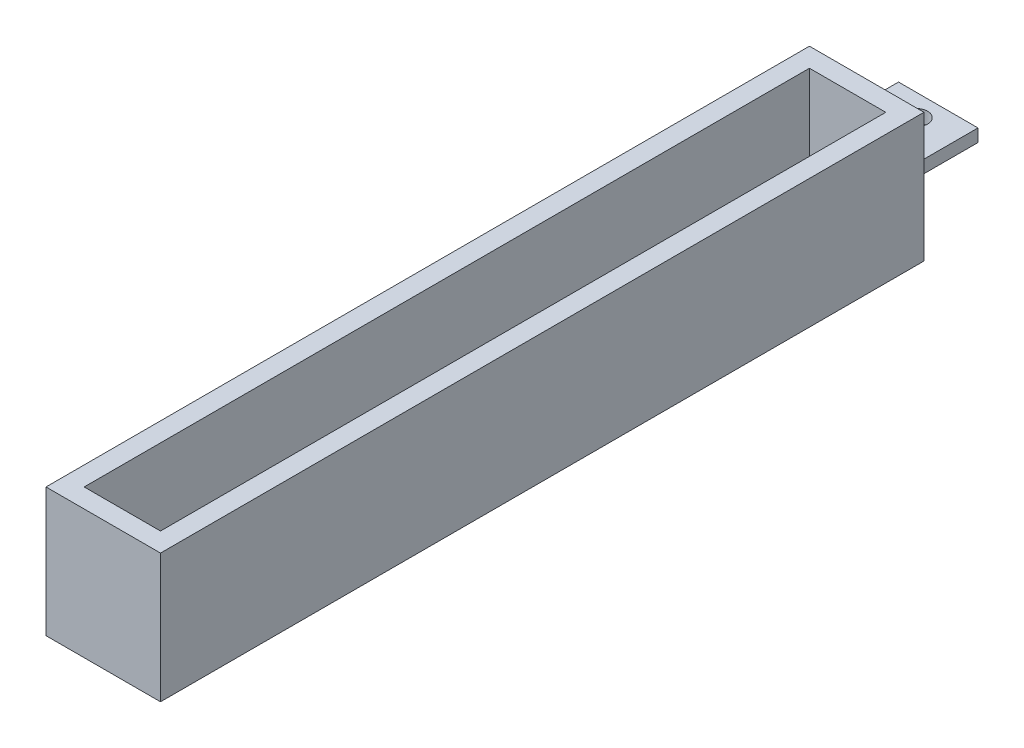
ISO-10303-21;
HEADER;
FILE_DESCRIPTION(('STEP AP214'),'2;1');
FILE_NAME('part.step','',(''),(''),'','','');
FILE_SCHEMA(('AUTOMOTIVE_DESIGN { 1 0 10303 214 1 1 1 1 }'));
ENDSEC;
DATA;
#1=APPLICATION_CONTEXT('core data for automotive mechanical design processes');
#2=APPLICATION_PROTOCOL_DEFINITION('international standard','automotive_design',2000,#1);
#3=PRODUCT_CONTEXT('',#1,'mechanical');
#4=PRODUCT('Part','Part','',(#3));
#5=PRODUCT_RELATED_PRODUCT_CATEGORY('part','',(#4));
#6=PRODUCT_DEFINITION_FORMATION('','',#4);
#7=PRODUCT_DEFINITION_CONTEXT('part definition',#1,'design');
#8=PRODUCT_DEFINITION('design','',#6,#7);
#9=PRODUCT_DEFINITION_SHAPE('','',#8);
#10=(LENGTH_UNIT() NAMED_UNIT(*) SI_UNIT(.MILLI.,.METRE.));
#11=(NAMED_UNIT(*) PLANE_ANGLE_UNIT() SI_UNIT($,.RADIAN.));
#12=(NAMED_UNIT(*) SI_UNIT($,.STERADIAN.) SOLID_ANGLE_UNIT());
#13=UNCERTAINTY_MEASURE_WITH_UNIT(LENGTH_MEASURE(1.E-05),#10,'distance_accuracy_value','');
#14=(GEOMETRIC_REPRESENTATION_CONTEXT(3) GLOBAL_UNCERTAINTY_ASSIGNED_CONTEXT((#13)) GLOBAL_UNIT_ASSIGNED_CONTEXT((#10,
#11,#12)) REPRESENTATION_CONTEXT('',''));
#15=CARTESIAN_POINT('',(0.,0.,0.));
#16=DIRECTION('',(0.,0.,1.));
#17=DIRECTION('',(1.,0.,0.));
#18=AXIS2_PLACEMENT_3D('',#15,#16,#17);
#19=CARTESIAN_POINT('',(0.,0.,0.));
#20=DIRECTION('',(0.,0.,-1.));
#21=DIRECTION('',(-1.,0.,0.));
#22=AXIS2_PLACEMENT_3D('',#19,#20,#21);
#23=PLANE('',#22);
#24=DIRECTION('',(0.,-1.,0.));
#25=VECTOR('',#24,1.);
#26=CARTESIAN_POINT('',(0.,0.,0.));
#27=LINE('',#26,#25);
#28=CARTESIAN_POINT('',(0.,27.,0.));
#29=VERTEX_POINT('',#28);
#30=CARTESIAN_POINT('',(0.,0.,0.));
#31=VERTEX_POINT('',#30);
#32=EDGE_CURVE('E160',#29,#31,#27,.T.);
#33=ORIENTED_EDGE('',*,*,#32,.F.);
#34=DIRECTION('',(-1.,0.,0.));
#35=VECTOR('',#34,1.);
#36=CARTESIAN_POINT('',(0.,27.,0.));
#37=LINE('',#36,#35);
#38=CARTESIAN_POINT('',(24.,27.,0.));
#39=VERTEX_POINT('',#38);
#40=EDGE_CURVE('E187',#39,#29,#37,.T.);
#41=ORIENTED_EDGE('',*,*,#40,.F.);
#42=DIRECTION('',(0.,1.,0.));
#43=VECTOR('',#42,1.);
#44=CARTESIAN_POINT('',(24.,0.,0.));
#45=LINE('',#44,#43);
#46=CARTESIAN_POINT('',(24.,0.,0.));
#47=VERTEX_POINT('',#46);
#48=EDGE_CURVE('E198',#47,#39,#45,.T.);
#49=ORIENTED_EDGE('',*,*,#48,.F.);
#50=DIRECTION('',(1.,0.,0.));
#51=VECTOR('',#50,1.);
#52=CARTESIAN_POINT('',(0.,0.,0.));
#53=LINE('',#52,#51);
#54=EDGE_CURVE('E196',#31,#47,#53,.T.);
#55=ORIENTED_EDGE('',*,*,#54,.F.);
#56=EDGE_LOOP('',(#33,#41,#49,#55));
#57=FACE_BOUND('',#56,.T.);
#58=DIRECTION('',(1.,0.,0.));
#59=VECTOR('',#58,1.);
#60=CARTESIAN_POINT('',(3.67203168883634,14.8278231899865,0.));
#61=LINE('',#60,#59);
#62=CARTESIAN_POINT('',(3.67203168883634,14.8278231899865,0.));
#63=VERTEX_POINT('',#62);
#64=CARTESIAN_POINT('',(20.3279683111637,14.8278231899865,0.));
#65=VERTEX_POINT('',#64);
#66=EDGE_CURVE('E289',#63,#65,#61,.T.);
#67=ORIENTED_EDGE('',*,*,#66,.F.);
#68=DIRECTION('',(0.,1.,0.));
#69=VECTOR('',#68,1.);
#70=CARTESIAN_POINT('',(3.67203168883634,14.8278231899865,0.));
#71=LINE('',#70,#69);
#72=CARTESIAN_POINT('',(3.67203168883634,12.1721768100135,0.));
#73=VERTEX_POINT('',#72);
#74=EDGE_CURVE('E147',#73,#63,#71,.T.);
#75=ORIENTED_EDGE('',*,*,#74,.F.);
#76=DIRECTION('',(-1.,0.,0.));
#77=VECTOR('',#76,1.);
#78=CARTESIAN_POINT('',(3.67203168883634,12.1721768100135,0.));
#79=LINE('',#78,#77);
#80=CARTESIAN_POINT('',(20.3279683111637,12.1721768100135,0.));
#81=VERTEX_POINT('',#80);
#82=EDGE_CURVE('E143',#81,#73,#79,.T.);
#83=ORIENTED_EDGE('',*,*,#82,.F.);
#84=DIRECTION('',(0.,-1.,0.));
#85=VECTOR('',#84,1.);
#86=CARTESIAN_POINT('',(20.3279683111637,14.8278231899865,0.));
#87=LINE('',#86,#85);
#88=EDGE_CURVE('E297',#65,#81,#87,.T.);
#89=ORIENTED_EDGE('',*,*,#88,.F.);
#90=EDGE_LOOP('',(#67,#75,#83,#89));
#91=FACE_BOUND('',#90,.T.);
#92=ADVANCED_FACE('F32',(#57,#91),#23,.T.);
#93=CARTESIAN_POINT('',(0.,27.,160.));
#94=DIRECTION('',(0.,-1.,0.));
#95=DIRECTION('',(0.,0.,-1.));
#96=AXIS2_PLACEMENT_3D('',#93,#94,#95);
#97=PLANE('',#96);
#98=ORIENTED_EDGE('',*,*,#40,.T.);
#99=DIRECTION('',(0.,0.,-1.));
#100=VECTOR('',#99,1.);
#101=CARTESIAN_POINT('',(0.,27.,160.));
#102=LINE('',#101,#100);
#103=CARTESIAN_POINT('',(0.,27.,160.));
#104=VERTEX_POINT('',#103);
#105=EDGE_CURVE('E193',#104,#29,#102,.T.);
#106=ORIENTED_EDGE('',*,*,#105,.F.);
#107=DIRECTION('',(-1.,0.,0.));
#108=VECTOR('',#107,1.);
#109=CARTESIAN_POINT('',(0.,27.,160.));
#110=LINE('',#109,#108);
#111=CARTESIAN_POINT('',(24.,27.,160.));
#112=VERTEX_POINT('',#111);
#113=EDGE_CURVE('E191',#112,#104,#110,.T.);
#114=ORIENTED_EDGE('',*,*,#113,.F.);
#115=DIRECTION('',(0.,0.,-1.));
#116=VECTOR('',#115,1.);
#117=CARTESIAN_POINT('',(24.,27.,160.));
#118=LINE('',#117,#116);
#119=EDGE_CURVE('E203',#112,#39,#118,.T.);
#120=ORIENTED_EDGE('',*,*,#119,.T.);
#121=EDGE_LOOP('',(#98,#106,#114,#120));
#122=FACE_BOUND('',#121,.T.);
#123=DIRECTION('',(-1.,0.,0.));
#124=VECTOR('',#123,1.);
#125=CARTESIAN_POINT('',(0.,27.,4.));
#126=LINE('',#125,#124);
#127=CARTESIAN_POINT('',(20.,27.,4.));
#128=VERTEX_POINT('',#127);
#129=CARTESIAN_POINT('',(4.,27.,4.));
#130=VERTEX_POINT('',#129);
#131=EDGE_CURVE('E166',#128,#130,#126,.T.);
#132=ORIENTED_EDGE('',*,*,#131,.F.);
#133=DIRECTION('',(0.,0.,-1.));
#134=VECTOR('',#133,1.);
#135=CARTESIAN_POINT('',(20.,27.,160.));
#136=LINE('',#135,#134);
#137=CARTESIAN_POINT('',(20.,27.,156.));
#138=VERTEX_POINT('',#137);
#139=EDGE_CURVE('E171',#138,#128,#136,.T.);
#140=ORIENTED_EDGE('',*,*,#139,.F.);
#141=DIRECTION('',(-1.,0.,0.));
#142=VECTOR('',#141,1.);
#143=CARTESIAN_POINT('',(0.,27.,156.));
#144=LINE('',#143,#142);
#145=CARTESIAN_POINT('',(4.,27.,156.));
#146=VERTEX_POINT('',#145);
#147=EDGE_CURVE('E56',#138,#146,#144,.T.);
#148=ORIENTED_EDGE('',*,*,#147,.T.);
#149=DIRECTION('',(0.,0.,-1.));
#150=VECTOR('',#149,1.);
#151=CARTESIAN_POINT('',(4.,27.,160.));
#152=LINE('',#151,#150);
#153=EDGE_CURVE('E176',#146,#130,#152,.T.);
#154=ORIENTED_EDGE('',*,*,#153,.T.);
#155=EDGE_LOOP('',(#132,#140,#148,#154));
#156=FACE_BOUND('',#155,.T.);
#157=ADVANCED_FACE('F220',(#122,#156),#97,.F.);
#158=CARTESIAN_POINT('',(0.,0.,160.));
#159=DIRECTION('',(1.,0.,0.));
#160=DIRECTION('',(0.,0.,-1.));
#161=AXIS2_PLACEMENT_3D('',#158,#159,#160);
#162=PLANE('',#161);
#163=ORIENTED_EDGE('',*,*,#32,.T.);
#164=DIRECTION('',(0.,0.,-1.));
#165=VECTOR('',#164,1.);
#166=CARTESIAN_POINT('',(0.,0.,160.));
#167=LINE('',#166,#165);
#168=CARTESIAN_POINT('',(0.,0.,160.));
#169=VERTEX_POINT('',#168);
#170=EDGE_CURVE('E11',#169,#31,#167,.T.);
#171=ORIENTED_EDGE('',*,*,#170,.F.);
#172=DIRECTION('',(0.,-1.,0.));
#173=VECTOR('',#172,1.);
#174=CARTESIAN_POINT('',(0.,0.,160.));
#175=LINE('',#174,#173);
#176=EDGE_CURVE('E183',#104,#169,#175,.T.);
#177=ORIENTED_EDGE('',*,*,#176,.F.);
#178=ORIENTED_EDGE('',*,*,#105,.T.);
#179=EDGE_LOOP('',(#163,#171,#177,#178));
#180=FACE_BOUND('',#179,.T.);
#181=ADVANCED_FACE('F34',(#180),#162,.F.);
#182=CARTESIAN_POINT('',(0.,0.,160.));
#183=DIRECTION('',(0.,1.,0.));
#184=DIRECTION('',(0.,0.,1.));
#185=AXIS2_PLACEMENT_3D('',#182,#183,#184);
#186=PLANE('',#185);
#187=ORIENTED_EDGE('',*,*,#54,.T.);
#188=DIRECTION('',(0.,0.,-1.));
#189=VECTOR('',#188,1.);
#190=CARTESIAN_POINT('',(24.,0.,160.));
#191=LINE('',#190,#189);
#192=CARTESIAN_POINT('',(24.,0.,160.));
#193=VERTEX_POINT('',#192);
#194=EDGE_CURVE('E41',#193,#47,#191,.T.);
#195=ORIENTED_EDGE('',*,*,#194,.F.);
#196=DIRECTION('',(1.,0.,0.));
#197=VECTOR('',#196,1.);
#198=CARTESIAN_POINT('',(0.,0.,160.));
#199=LINE('',#198,#197);
#200=EDGE_CURVE('E186',#169,#193,#199,.T.);
#201=ORIENTED_EDGE('',*,*,#200,.F.);
#202=ORIENTED_EDGE('',*,*,#170,.T.);
#203=EDGE_LOOP('',(#187,#195,#201,#202));
#204=FACE_BOUND('',#203,.T.);
#205=ADVANCED_FACE('F228',(#204),#186,.F.);
#206=CARTESIAN_POINT('',(24.,0.,160.));
#207=DIRECTION('',(-1.,0.,0.));
#208=DIRECTION('',(0.,0.,1.));
#209=AXIS2_PLACEMENT_3D('',#206,#207,#208);
#210=PLANE('',#209);
#211=ORIENTED_EDGE('',*,*,#48,.T.);
#212=ORIENTED_EDGE('',*,*,#119,.F.);
#213=DIRECTION('',(0.,1.,0.));
#214=VECTOR('',#213,1.);
#215=CARTESIAN_POINT('',(24.,0.,160.));
#216=LINE('',#215,#214);
#217=EDGE_CURVE('E189',#193,#112,#216,.T.);
#218=ORIENTED_EDGE('',*,*,#217,.F.);
#219=ORIENTED_EDGE('',*,*,#194,.T.);
#220=EDGE_LOOP('',(#211,#212,#218,#219));
#221=FACE_BOUND('',#220,.T.);
#222=ADVANCED_FACE('F211',(#221),#210,.F.);
#223=CARTESIAN_POINT('',(0.,0.,160.));
#224=DIRECTION('',(0.,0.,-1.));
#225=DIRECTION('',(-1.,0.,0.));
#226=AXIS2_PLACEMENT_3D('',#223,#224,#225);
#227=PLANE('',#226);
#228=ORIENTED_EDGE('',*,*,#176,.T.);
#229=ORIENTED_EDGE('',*,*,#200,.T.);
#230=ORIENTED_EDGE('',*,*,#217,.T.);
#231=ORIENTED_EDGE('',*,*,#113,.T.);
#232=EDGE_LOOP('',(#228,#229,#230,#231));
#233=FACE_BOUND('',#232,.T.);
#234=ADVANCED_FACE('F227',(#233),#227,.F.);
#235=CARTESIAN_POINT('',(4.,0.,160.));
#236=DIRECTION('',(1.,0.,0.));
#237=DIRECTION('',(0.,0.,-1.));
#238=AXIS2_PLACEMENT_3D('',#235,#236,#237);
#239=PLANE('',#238);
#240=DIRECTION('',(0.,-1.,0.));
#241=VECTOR('',#240,1.);
#242=CARTESIAN_POINT('',(4.,0.,4.));
#243=LINE('',#242,#241);
#244=CARTESIAN_POINT('',(4.,4.,4.));
#245=VERTEX_POINT('',#244);
#246=EDGE_CURVE('E149',#130,#245,#243,.T.);
#247=ORIENTED_EDGE('',*,*,#246,.F.);
#248=ORIENTED_EDGE('',*,*,#153,.F.);
#249=DIRECTION('',(0.,-1.,0.));
#250=VECTOR('',#249,1.);
#251=CARTESIAN_POINT('',(4.,0.,156.));
#252=LINE('',#251,#250);
#253=CARTESIAN_POINT('',(4.,4.,156.));
#254=VERTEX_POINT('',#253);
#255=EDGE_CURVE('E162',#146,#254,#252,.T.);
#256=ORIENTED_EDGE('',*,*,#255,.T.);
#257=DIRECTION('',(0.,0.,-1.));
#258=VECTOR('',#257,1.);
#259=CARTESIAN_POINT('',(4.,4.,160.));
#260=LINE('',#259,#258);
#261=EDGE_CURVE('E157',#254,#245,#260,.T.);
#262=ORIENTED_EDGE('',*,*,#261,.T.);
#263=EDGE_LOOP('',(#247,#248,#256,#262));
#264=FACE_BOUND('',#263,.T.);
#265=ADVANCED_FACE('F244',(#264),#239,.T.);
#266=CARTESIAN_POINT('',(0.,4.,160.));
#267=DIRECTION('',(0.,1.,0.));
#268=DIRECTION('',(0.,0.,1.));
#269=AXIS2_PLACEMENT_3D('',#266,#267,#268);
#270=PLANE('',#269);
#271=DIRECTION('',(1.,0.,0.));
#272=VECTOR('',#271,1.);
#273=CARTESIAN_POINT('',(0.,4.,4.));
#274=LINE('',#273,#272);
#275=CARTESIAN_POINT('',(20.,4.,4.));
#276=VERTEX_POINT('',#275);
#277=EDGE_CURVE('E152',#245,#276,#274,.T.);
#278=ORIENTED_EDGE('',*,*,#277,.F.);
#279=ORIENTED_EDGE('',*,*,#261,.F.);
#280=DIRECTION('',(1.,0.,0.));
#281=VECTOR('',#280,1.);
#282=CARTESIAN_POINT('',(0.,4.,156.));
#283=LINE('',#282,#281);
#284=CARTESIAN_POINT('',(20.,4.,156.));
#285=VERTEX_POINT('',#284);
#286=EDGE_CURVE('E165',#254,#285,#283,.T.);
#287=ORIENTED_EDGE('',*,*,#286,.T.);
#288=DIRECTION('',(0.,0.,-1.));
#289=VECTOR('',#288,1.);
#290=CARTESIAN_POINT('',(20.,4.,160.));
#291=LINE('',#290,#289);
#292=EDGE_CURVE('E161',#285,#276,#291,.T.);
#293=ORIENTED_EDGE('',*,*,#292,.T.);
#294=EDGE_LOOP('',(#278,#279,#287,#293));
#295=FACE_BOUND('',#294,.T.);
#296=ADVANCED_FACE('F255',(#295),#270,.T.);
#297=CARTESIAN_POINT('',(20.,0.,160.));
#298=DIRECTION('',(-1.,0.,0.));
#299=DIRECTION('',(0.,0.,1.));
#300=AXIS2_PLACEMENT_3D('',#297,#298,#299);
#301=PLANE('',#300);
#302=DIRECTION('',(0.,1.,0.));
#303=VECTOR('',#302,1.);
#304=CARTESIAN_POINT('',(20.,0.,4.));
#305=LINE('',#304,#303);
#306=EDGE_CURVE('E168',#276,#128,#305,.T.);
#307=ORIENTED_EDGE('',*,*,#306,.F.);
#308=ORIENTED_EDGE('',*,*,#292,.F.);
#309=DIRECTION('',(0.,1.,0.));
#310=VECTOR('',#309,1.);
#311=CARTESIAN_POINT('',(20.,0.,156.));
#312=LINE('',#311,#310);
#313=EDGE_CURVE('E173',#285,#138,#312,.T.);
#314=ORIENTED_EDGE('',*,*,#313,.T.);
#315=ORIENTED_EDGE('',*,*,#139,.T.);
#316=EDGE_LOOP('',(#307,#308,#314,#315));
#317=FACE_BOUND('',#316,.T.);
#318=ADVANCED_FACE('F252',(#317),#301,.T.);
#319=CARTESIAN_POINT('',(0.,0.,156.));
#320=DIRECTION('',(0.,0.,-1.));
#321=DIRECTION('',(-1.,0.,0.));
#322=AXIS2_PLACEMENT_3D('',#319,#320,#321);
#323=PLANE('',#322);
#324=ORIENTED_EDGE('',*,*,#255,.F.);
#325=ORIENTED_EDGE('',*,*,#147,.F.);
#326=ORIENTED_EDGE('',*,*,#313,.F.);
#327=ORIENTED_EDGE('',*,*,#286,.F.);
#328=EDGE_LOOP('',(#324,#325,#326,#327));
#329=FACE_BOUND('',#328,.T.);
#330=ADVANCED_FACE('F248',(#329),#323,.T.);
#331=CARTESIAN_POINT('',(0.,0.,4.));
#332=DIRECTION('',(0.,0.,-1.));
#333=DIRECTION('',(-1.,0.,0.));
#334=AXIS2_PLACEMENT_3D('',#331,#332,#333);
#335=PLANE('',#334);
#336=ORIENTED_EDGE('',*,*,#246,.T.);
#337=ORIENTED_EDGE('',*,*,#277,.T.);
#338=ORIENTED_EDGE('',*,*,#306,.T.);
#339=ORIENTED_EDGE('',*,*,#131,.T.);
#340=EDGE_LOOP('',(#336,#337,#338,#339));
#341=FACE_BOUND('',#340,.T.);
#342=ADVANCED_FACE('F245',(#341),#335,.F.);
#343=CARTESIAN_POINT('',(3.67203168883634,14.8278231899865,-15.));
#344=DIRECTION('',(1.,0.,0.));
#345=DIRECTION('',(0.,1.,0.));
#346=AXIS2_PLACEMENT_3D('',#343,#344,#345);
#347=PLANE('',#346);
#348=ORIENTED_EDGE('',*,*,#74,.T.);
#349=DIRECTION('',(0.,0.,1.));
#350=VECTOR('',#349,1.);
#351=CARTESIAN_POINT('',(3.67203168883634,14.8278231899865,-15.));
#352=LINE('',#351,#350);
#353=CARTESIAN_POINT('',(3.67203168883634,14.8278231899865,-15.));
#354=VERTEX_POINT('',#353);
#355=EDGE_CURVE('E128',#354,#63,#352,.T.);
#356=ORIENTED_EDGE('',*,*,#355,.F.);
#357=DIRECTION('',(0.,1.,0.));
#358=VECTOR('',#357,1.);
#359=CARTESIAN_POINT('',(3.67203168883634,14.8278231899865,-15.));
#360=LINE('',#359,#358);
#361=CARTESIAN_POINT('',(3.67203168883634,12.1721768100135,-15.));
#362=VERTEX_POINT('',#361);
#363=EDGE_CURVE('E135',#362,#354,#360,.T.);
#364=ORIENTED_EDGE('',*,*,#363,.F.);
#365=DIRECTION('',(0.,0.,1.));
#366=VECTOR('',#365,1.);
#367=CARTESIAN_POINT('',(3.67203168883634,12.1721768100135,-15.));
#368=LINE('',#367,#366);
#369=EDGE_CURVE('E294',#362,#73,#368,.T.);
#370=ORIENTED_EDGE('',*,*,#369,.T.);
#371=EDGE_LOOP('',(#348,#356,#364,#370));
#372=FACE_BOUND('',#371,.T.);
#373=ADVANCED_FACE('F145',(#372),#347,.F.);
#374=CARTESIAN_POINT('',(3.67203168883634,14.8278231899865,-15.));
#375=DIRECTION('',(0.,-1.,0.));
#376=DIRECTION('',(0.,0.,-1.));
#377=AXIS2_PLACEMENT_3D('',#374,#375,#376);
#378=PLANE('',#377);
#379=CARTESIAN_POINT('',(12.,14.8278231899865,-10.4030934387273));
#380=DIRECTION('',(0.,1.,0.));
#381=DIRECTION('',(-1.,0.,0.));
#382=AXIS2_PLACEMENT_3D('',#379,#380,#381);
#383=CIRCLE('',#382,2.35199125708439);
#384=CARTESIAN_POINT('',(9.64800874291561,14.8278231899865,-10.4030934387273));
#385=VERTEX_POINT('',#384);
#386=EDGE_CURVE('E286',#385,#385,#383,.T.);
#387=ORIENTED_EDGE('',*,*,#386,.F.);
#388=EDGE_LOOP('',(#387));
#389=FACE_BOUND('',#388,.T.);
#390=ORIENTED_EDGE('',*,*,#66,.T.);
#391=DIRECTION('',(0.,0.,1.));
#392=VECTOR('',#391,1.);
#393=CARTESIAN_POINT('',(20.3279683111637,14.8278231899865,-15.));
#394=LINE('',#393,#392);
#395=CARTESIAN_POINT('',(20.3279683111637,14.8278231899865,-15.));
#396=VERTEX_POINT('',#395);
#397=EDGE_CURVE('E131',#396,#65,#394,.T.);
#398=ORIENTED_EDGE('',*,*,#397,.F.);
#399=DIRECTION('',(1.,0.,0.));
#400=VECTOR('',#399,1.);
#401=CARTESIAN_POINT('',(3.67203168883634,14.8278231899865,-15.));
#402=LINE('',#401,#400);
#403=EDGE_CURVE('E124',#354,#396,#402,.T.);
#404=ORIENTED_EDGE('',*,*,#403,.F.);
#405=ORIENTED_EDGE('',*,*,#355,.T.);
#406=EDGE_LOOP('',(#390,#398,#404,#405));
#407=FACE_BOUND('',#406,.T.);
#408=ADVANCED_FACE('F126',(#389,#407),#378,.F.);
#409=CARTESIAN_POINT('',(20.3279683111637,14.8278231899865,-15.));
#410=DIRECTION('',(-1.,0.,0.));
#411=DIRECTION('',(0.,0.,1.));
#412=AXIS2_PLACEMENT_3D('',#409,#410,#411);
#413=PLANE('',#412);
#414=ORIENTED_EDGE('',*,*,#88,.T.);
#415=DIRECTION('',(0.,0.,1.));
#416=VECTOR('',#415,1.);
#417=CARTESIAN_POINT('',(20.3279683111637,12.1721768100135,-15.));
#418=LINE('',#417,#416);
#419=CARTESIAN_POINT('',(20.3279683111637,12.1721768100135,-15.));
#420=VERTEX_POINT('',#419);
#421=EDGE_CURVE('E48',#420,#81,#418,.T.);
#422=ORIENTED_EDGE('',*,*,#421,.F.);
#423=DIRECTION('',(0.,-1.,0.));
#424=VECTOR('',#423,1.);
#425=CARTESIAN_POINT('',(20.3279683111637,14.8278231899865,-15.));
#426=LINE('',#425,#424);
#427=EDGE_CURVE('E134',#396,#420,#426,.T.);
#428=ORIENTED_EDGE('',*,*,#427,.F.);
#429=ORIENTED_EDGE('',*,*,#397,.T.);
#430=EDGE_LOOP('',(#414,#422,#428,#429));
#431=FACE_BOUND('',#430,.T.);
#432=ADVANCED_FACE('F267',(#431),#413,.F.);
#433=CARTESIAN_POINT('',(3.67203168883634,12.1721768100135,-15.));
#434=DIRECTION('',(0.,1.,0.));
#435=DIRECTION('',(0.,0.,1.));
#436=AXIS2_PLACEMENT_3D('',#433,#434,#435);
#437=PLANE('',#436);
#438=CARTESIAN_POINT('',(12.,12.1721768100135,-10.4030934387273));
#439=DIRECTION('',(0.,1.,0.));
#440=DIRECTION('',(0.,0.,1.));
#441=AXIS2_PLACEMENT_3D('',#438,#439,#440);
#442=CIRCLE('',#441,2.35199125708439);
#443=CARTESIAN_POINT('',(12.,12.1721768100135,-8.05110218164291));
#444=VERTEX_POINT('',#443);
#445=EDGE_CURVE('E36',#444,#444,#442,.T.);
#446=ORIENTED_EDGE('',*,*,#445,.T.);
#447=EDGE_LOOP('',(#446));
#448=FACE_BOUND('',#447,.T.);
#449=ORIENTED_EDGE('',*,*,#82,.T.);
#450=ORIENTED_EDGE('',*,*,#369,.F.);
#451=DIRECTION('',(-1.,0.,0.));
#452=VECTOR('',#451,1.);
#453=CARTESIAN_POINT('',(3.67203168883634,12.1721768100135,-15.));
#454=LINE('',#453,#452);
#455=EDGE_CURVE('E139',#420,#362,#454,.T.);
#456=ORIENTED_EDGE('',*,*,#455,.F.);
#457=ORIENTED_EDGE('',*,*,#421,.T.);
#458=EDGE_LOOP('',(#449,#450,#456,#457));
#459=FACE_BOUND('',#458,.T.);
#460=ADVANCED_FACE('F271',(#448,#459),#437,.F.);
#461=CARTESIAN_POINT('',(0.,0.,-15.));
#462=DIRECTION('',(0.,0.,1.));
#463=DIRECTION('',(1.,0.,0.));
#464=AXIS2_PLACEMENT_3D('',#461,#462,#463);
#465=PLANE('',#464);
#466=ORIENTED_EDGE('',*,*,#363,.T.);
#467=ORIENTED_EDGE('',*,*,#403,.T.);
#468=ORIENTED_EDGE('',*,*,#427,.T.);
#469=ORIENTED_EDGE('',*,*,#455,.T.);
#470=EDGE_LOOP('',(#466,#467,#468,#469));
#471=FACE_BOUND('',#470,.T.);
#472=ADVANCED_FACE('F138',(#471),#465,.F.);
#473=CARTESIAN_POINT('',(12.,0.,-10.4030934387273));
#474=DIRECTION('',(0.,1.,0.));
#475=DIRECTION('',(-1.,0.,0.));
#476=AXIS2_PLACEMENT_3D('',#473,#474,#475);
#477=CYLINDRICAL_SURFACE('',#476,2.35199125708439);
#478=ORIENTED_EDGE('',*,*,#386,.T.);
#479=EDGE_LOOP('',(#478));
#480=FACE_BOUND('',#479,.T.);
#481=ORIENTED_EDGE('',*,*,#445,.F.);
#482=EDGE_LOOP('',(#481));
#483=FACE_BOUND('',#482,.T.);
#484=ADVANCED_FACE('F278',(#480,#483),#477,.F.);
#485=CLOSED_SHELL('',(#92,#157,#181,#205,#222,#234,#265,#296,#318,#330,#342,#373,#408,#432,#460,
#472,#484));
#486=MANIFOLD_SOLID_BREP('B2',#485);
#487=ADVANCED_BREP_SHAPE_REPRESENTATION('',(#18,#486),#14);
#488=SHAPE_DEFINITION_REPRESENTATION(#9,#487);
ENDSEC;
END-ISO-10303-21;
